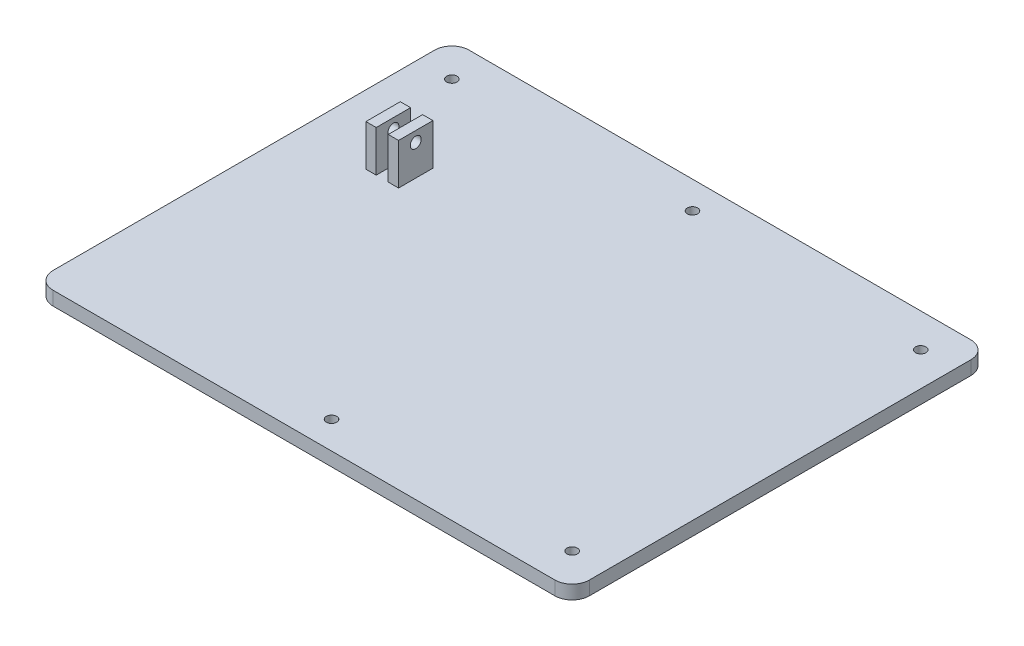
ISO-10303-21;
HEADER;
FILE_DESCRIPTION(('STEP AP214'),'2;1');
FILE_NAME('part.step','',(''),(''),'','','');
FILE_SCHEMA(('AUTOMOTIVE_DESIGN { 1 0 10303 214 1 1 1 1 }'));
ENDSEC;
DATA;
#1=APPLICATION_CONTEXT('core data for automotive mechanical design processes');
#2=APPLICATION_PROTOCOL_DEFINITION('international standard','automotive_design',2000,#1);
#3=PRODUCT_CONTEXT('',#1,'mechanical');
#4=PRODUCT('Part','Part','',(#3));
#5=PRODUCT_RELATED_PRODUCT_CATEGORY('part','',(#4));
#6=PRODUCT_DEFINITION_FORMATION('','',#4);
#7=PRODUCT_DEFINITION_CONTEXT('part definition',#1,'design');
#8=PRODUCT_DEFINITION('design','',#6,#7);
#9=PRODUCT_DEFINITION_SHAPE('','',#8);
#10=(LENGTH_UNIT() NAMED_UNIT(*) SI_UNIT(.MILLI.,.METRE.));
#11=(NAMED_UNIT(*) PLANE_ANGLE_UNIT() SI_UNIT($,.RADIAN.));
#12=(NAMED_UNIT(*) SI_UNIT($,.STERADIAN.) SOLID_ANGLE_UNIT());
#13=UNCERTAINTY_MEASURE_WITH_UNIT(LENGTH_MEASURE(1.E-05),#10,'distance_accuracy_value','');
#14=(GEOMETRIC_REPRESENTATION_CONTEXT(3) GLOBAL_UNCERTAINTY_ASSIGNED_CONTEXT((#13)) GLOBAL_UNIT_ASSIGNED_CONTEXT((#10,
#11,#12)) REPRESENTATION_CONTEXT('',''));
#15=CARTESIAN_POINT('',(0.,0.,0.));
#16=DIRECTION('',(0.,0.,1.));
#17=DIRECTION('',(1.,0.,0.));
#18=AXIS2_PLACEMENT_3D('',#15,#16,#17);
#19=CARTESIAN_POINT('',(0.,4.,0.));
#20=DIRECTION('',(0.,-1.,0.));
#21=DIRECTION('',(0.,0.,-1.));
#22=AXIS2_PLACEMENT_3D('',#19,#20,#21);
#23=PLANE('',#22);
#24=CARTESIAN_POINT('',(-29.1272060053833,4.,15.0292186824437));
#25=DIRECTION('',(0.,1.,0.));
#26=DIRECTION('',(0.,0.,1.));
#27=AXIS2_PLACEMENT_3D('',#24,#25,#26);
#28=CIRCLE('',#27,1.);
#29=CARTESIAN_POINT('',(-29.1272060053833,4.,16.0292186824437));
#30=VERTEX_POINT('',#29);
#31=EDGE_CURVE('E312',#30,#30,#28,.T.);
#32=ORIENTED_EDGE('',*,*,#31,.F.);
#33=EDGE_LOOP('',(#32));
#34=FACE_BOUND('',#33,.T.);
#35=DIRECTION('',(0.,0.,-1.));
#36=VECTOR('',#35,1.);
#37=CARTESIAN_POINT('',(-30.6280356985237,4.,9.78105868106154));
#38=LINE('',#37,#36);
#39=CARTESIAN_POINT('',(-30.6280356985237,4.,19.7810586810616));
#40=VERTEX_POINT('',#39);
#41=CARTESIAN_POINT('',(-30.6280356985237,4.,9.78105868106154));
#42=VERTEX_POINT('',#41);
#43=EDGE_CURVE('E153',#40,#42,#38,.T.);
#44=ORIENTED_EDGE('',*,*,#43,.F.);
#45=DIRECTION('',(1.,0.,0.));
#46=VECTOR('',#45,1.);
#47=CARTESIAN_POINT('',(-30.6280356985237,4.,19.7810586810616));
#48=LINE('',#47,#46);
#49=CARTESIAN_POINT('',(-33.6280356985237,4.,19.7810586810615));
#50=VERTEX_POINT('',#49);
#51=EDGE_CURVE('E186',#50,#40,#48,.T.);
#52=ORIENTED_EDGE('',*,*,#51,.F.);
#53=DIRECTION('',(0.,0.,1.));
#54=VECTOR('',#53,1.);
#55=CARTESIAN_POINT('',(-33.6280356985237,4.,9.78105868106155));
#56=LINE('',#55,#54);
#57=CARTESIAN_POINT('',(-33.6280356985237,4.,9.78105868106155));
#58=VERTEX_POINT('',#57);
#59=EDGE_CURVE('E198',#58,#50,#56,.T.);
#60=ORIENTED_EDGE('',*,*,#59,.F.);
#61=DIRECTION('',(-1.,0.,0.));
#62=VECTOR('',#61,1.);
#63=CARTESIAN_POINT('',(-30.6280356985237,4.,9.78105868106154));
#64=LINE('',#63,#62);
#65=EDGE_CURVE('E195',#42,#58,#64,.T.);
#66=ORIENTED_EDGE('',*,*,#65,.F.);
#67=EDGE_LOOP('',(#44,#52,#60,#66));
#68=FACE_BOUND('',#67,.T.);
#69=CARTESIAN_POINT('',(-43.8247348396246,4.,-15.4156404600393));
#70=DIRECTION('',(0.,1.,0.));
#71=DIRECTION('',(0.,0.,1.));
#72=AXIS2_PLACEMENT_3D('',#69,#70,#71);
#73=CIRCLE('',#72,1.5);
#74=CARTESIAN_POINT('',(-43.8247348396246,4.,-13.9156404600393));
#75=VERTEX_POINT('',#74);
#76=EDGE_CURVE('E219',#75,#75,#73,.T.);
#77=ORIENTED_EDGE('',*,*,#76,.F.);
#78=EDGE_LOOP('',(#77));
#79=FACE_BOUND('',#78,.T.);
#80=CARTESIAN_POINT('',(24.3719643014763,4.,-17.2189413189384));
#81=DIRECTION('',(0.,1.,0.));
#82=DIRECTION('',(0.,0.,1.));
#83=AXIS2_PLACEMENT_3D('',#80,#81,#82);
#84=CIRCLE('',#83,1.5);
#85=CARTESIAN_POINT('',(24.3719643014763,4.,-15.7189413189384));
#86=VERTEX_POINT('',#85);
#87=EDGE_CURVE('E222',#86,#86,#84,.T.);
#88=ORIENTED_EDGE('',*,*,#87,.F.);
#89=EDGE_LOOP('',(#88));
#90=FACE_BOUND('',#89,.T.);
#91=CARTESIAN_POINT('',(92.5686634425771,4.,-15.4156404600393));
#92=DIRECTION('',(0.,1.,0.));
#93=DIRECTION('',(0.,0.,1.));
#94=AXIS2_PLACEMENT_3D('',#91,#92,#93);
#95=CIRCLE('',#94,1.5);
#96=CARTESIAN_POINT('',(92.5686634425771,4.,-13.9156404600393));
#97=VERTEX_POINT('',#96);
#98=EDGE_CURVE('E228',#97,#97,#95,.T.);
#99=ORIENTED_EDGE('',*,*,#98,.F.);
#100=EDGE_LOOP('',(#99));
#101=FACE_BOUND('',#100,.T.);
#102=CARTESIAN_POINT('',(24.3719643014763,4.,87.7810586810615));
#103=DIRECTION('',(0.,1.,0.));
#104=DIRECTION('',(0.,0.,1.));
#105=AXIS2_PLACEMENT_3D('',#102,#103,#104);
#106=CIRCLE('',#105,1.5);
#107=CARTESIAN_POINT('',(24.3719643014763,4.,89.2810586810615));
#108=VERTEX_POINT('',#107);
#109=EDGE_CURVE('E234',#108,#108,#106,.T.);
#110=ORIENTED_EDGE('',*,*,#109,.F.);
#111=EDGE_LOOP('',(#110));
#112=FACE_BOUND('',#111,.T.);
#113=CARTESIAN_POINT('',(92.5686634425772,4.,85.9777578221625));
#114=DIRECTION('',(0.,1.,0.));
#115=DIRECTION('',(0.,0.,1.));
#116=AXIS2_PLACEMENT_3D('',#113,#114,#115);
#117=CIRCLE('',#116,1.5);
#118=CARTESIAN_POINT('',(92.5686634425772,4.,87.4777578221625));
#119=VERTEX_POINT('',#118);
#120=EDGE_CURVE('E240',#119,#119,#117,.T.);
#121=ORIENTED_EDGE('',*,*,#120,.F.);
#122=EDGE_LOOP('',(#121));
#123=FACE_BOUND('',#122,.T.);
#124=DIRECTION('',(1.,0.,0.));
#125=VECTOR('',#124,1.);
#126=CARTESIAN_POINT('',(-124.347339340326,4.,95.7810586810616));
#127=LINE('',#126,#125);
#128=CARTESIAN_POINT('',(-48.6280356985237,4.,95.7810586810616));
#129=VERTEX_POINT('',#128);
#130=CARTESIAN_POINT('',(97.3719643014763,4.,95.7810586810616));
#131=VERTEX_POINT('',#130);
#132=EDGE_CURVE('E282',#129,#131,#127,.T.);
#133=ORIENTED_EDGE('',*,*,#132,.T.);
#134=CARTESIAN_POINT('',(97.3719643014763,4.,90.7810586810616));
#135=DIRECTION('',(0.,-1.,0.));
#136=DIRECTION('',(0.,0.,1.));
#137=AXIS2_PLACEMENT_3D('',#134,#135,#136);
#138=CIRCLE('',#137,5.);
#139=CARTESIAN_POINT('',(102.371964301476,4.,90.7810586810616));
#140=VERTEX_POINT('',#139);
#141=EDGE_CURVE('E262',#140,#131,#138,.T.);
#142=ORIENTED_EDGE('',*,*,#141,.F.);
#143=DIRECTION('',(0.,0.,1.));
#144=VECTOR('',#143,1.);
#145=CARTESIAN_POINT('',(102.371964301476,4.,90.7810586810616));
#146=LINE('',#145,#144);
#147=CARTESIAN_POINT('',(102.371964301476,4.,-20.2189413189384));
#148=VERTEX_POINT('',#147);
#149=EDGE_CURVE('E259',#148,#140,#146,.T.);
#150=ORIENTED_EDGE('',*,*,#149,.F.);
#151=CARTESIAN_POINT('',(97.3719643014763,4.,-20.2189413189384));
#152=DIRECTION('',(0.,-1.,0.));
#153=DIRECTION('',(0.,0.,1.));
#154=AXIS2_PLACEMENT_3D('',#151,#152,#153);
#155=CIRCLE('',#154,5.);
#156=CARTESIAN_POINT('',(97.3719643014763,4.,-25.2189413189384));
#157=VERTEX_POINT('',#156);
#158=EDGE_CURVE('E256',#157,#148,#155,.T.);
#159=ORIENTED_EDGE('',*,*,#158,.F.);
#160=DIRECTION('',(1.,0.,0.));
#161=VECTOR('',#160,1.);
#162=CARTESIAN_POINT('',(97.3719643014763,4.,-25.2189413189384));
#163=LINE('',#162,#161);
#164=CARTESIAN_POINT('',(-48.6280356985237,4.,-25.2189413189385));
#165=VERTEX_POINT('',#164);
#166=EDGE_CURVE('E253',#165,#157,#163,.T.);
#167=ORIENTED_EDGE('',*,*,#166,.F.);
#168=CARTESIAN_POINT('',(-48.6280356985237,4.,-20.2189413189385));
#169=DIRECTION('',(0.,-1.,0.));
#170=DIRECTION('',(0.,0.,1.));
#171=AXIS2_PLACEMENT_3D('',#168,#169,#170);
#172=CIRCLE('',#171,5.);
#173=CARTESIAN_POINT('',(-53.6280356985237,4.,-20.2189413189385));
#174=VERTEX_POINT('',#173);
#175=EDGE_CURVE('E250',#174,#165,#172,.T.);
#176=ORIENTED_EDGE('',*,*,#175,.F.);
#177=DIRECTION('',(0.,0.,-1.));
#178=VECTOR('',#177,1.);
#179=CARTESIAN_POINT('',(-53.6280356985237,4.,-20.2189413189385));
#180=LINE('',#179,#178);
#181=CARTESIAN_POINT('',(-53.6280356985237,4.,90.7810586810616));
#182=VERTEX_POINT('',#181);
#183=EDGE_CURVE('E247',#182,#174,#180,.T.);
#184=ORIENTED_EDGE('',*,*,#183,.F.);
#185=CARTESIAN_POINT('',(-48.6280356985237,4.,90.7810586810616));
#186=DIRECTION('',(0.,-1.,0.));
#187=DIRECTION('',(0.,0.,1.));
#188=AXIS2_PLACEMENT_3D('',#185,#186,#187);
#189=CIRCLE('',#188,5.);
#190=EDGE_CURVE('E218',#129,#182,#189,.T.);
#191=ORIENTED_EDGE('',*,*,#190,.F.);
#192=EDGE_LOOP('',(#133,#142,#150,#159,#167,#176,#184,#191));
#193=FACE_BOUND('',#192,.T.);
#194=DIRECTION('',(0.,0.,-1.));
#195=VECTOR('',#194,1.);
#196=CARTESIAN_POINT('',(-24.1280356985237,4.,9.78105868106155));
#197=LINE('',#196,#195);
#198=CARTESIAN_POINT('',(-24.1280356985237,4.,19.7810586810615));
#199=VERTEX_POINT('',#198);
#200=CARTESIAN_POINT('',(-24.1280356985237,4.,9.78105868106155));
#201=VERTEX_POINT('',#200);
#202=EDGE_CURVE('E147',#199,#201,#197,.T.);
#203=ORIENTED_EDGE('',*,*,#202,.F.);
#204=DIRECTION('',(1.,0.,0.));
#205=VECTOR('',#204,1.);
#206=CARTESIAN_POINT('',(-24.1280356985237,4.,19.7810586810615));
#207=LINE('',#206,#205);
#208=CARTESIAN_POINT('',(-27.1280356985237,4.,19.7810586810615));
#209=VERTEX_POINT('',#208);
#210=EDGE_CURVE('E149',#209,#199,#207,.T.);
#211=ORIENTED_EDGE('',*,*,#210,.F.);
#212=DIRECTION('',(0.,0.,1.));
#213=VECTOR('',#212,1.);
#214=CARTESIAN_POINT('',(-27.1280356985237,4.,9.78105868106155));
#215=LINE('',#214,#213);
#216=CARTESIAN_POINT('',(-27.1280356985237,4.,9.78105868106155));
#217=VERTEX_POINT('',#216);
#218=EDGE_CURVE('E59',#217,#209,#215,.T.);
#219=ORIENTED_EDGE('',*,*,#218,.F.);
#220=DIRECTION('',(-1.,0.,0.));
#221=VECTOR('',#220,1.);
#222=CARTESIAN_POINT('',(-24.1280356985237,4.,9.78105868106155));
#223=LINE('',#222,#221);
#224=EDGE_CURVE('E54',#201,#217,#223,.T.);
#225=ORIENTED_EDGE('',*,*,#224,.F.);
#226=EDGE_LOOP('',(#203,#211,#219,#225));
#227=FACE_BOUND('',#226,.T.);
#228=ADVANCED_FACE('F37',(#34,#68,#79,#90,#101,#112,#123,#193,#227),#23,.F.);
#229=CARTESIAN_POINT('',(-124.347339340326,4.,95.7810586810616));
#230=DIRECTION('',(0.,0.,-1.));
#231=DIRECTION('',(-1.,0.,0.));
#232=AXIS2_PLACEMENT_3D('',#229,#230,#231);
#233=PLANE('',#232);
#234=DIRECTION('',(0.,1.,0.));
#235=VECTOR('',#234,1.);
#236=CARTESIAN_POINT('',(97.3719643014763,-6.,95.7810586810616));
#237=LINE('',#236,#235);
#238=CARTESIAN_POINT('',(97.3719643014763,0.,95.7810586810616));
#239=VERTEX_POINT('',#238);
#240=EDGE_CURVE('E265',#239,#131,#237,.T.);
#241=ORIENTED_EDGE('',*,*,#240,.T.);
#242=ORIENTED_EDGE('',*,*,#132,.F.);
#243=DIRECTION('',(0.,1.,0.));
#244=VECTOR('',#243,1.);
#245=CARTESIAN_POINT('',(-48.6280356985237,-6.,95.7810586810616));
#246=LINE('',#245,#244);
#247=CARTESIAN_POINT('',(-48.6280356985237,0.,95.7810586810616));
#248=VERTEX_POINT('',#247);
#249=EDGE_CURVE('E264',#248,#129,#246,.T.);
#250=ORIENTED_EDGE('',*,*,#249,.F.);
#251=DIRECTION('',(1.,0.,0.));
#252=VECTOR('',#251,1.);
#253=CARTESIAN_POINT('',(-124.347339340326,0.,95.7810586810616));
#254=LINE('',#253,#252);
#255=EDGE_CURVE('E268',#248,#239,#254,.T.);
#256=ORIENTED_EDGE('',*,*,#255,.T.);
#257=EDGE_LOOP('',(#241,#242,#250,#256));
#258=FACE_BOUND('',#257,.T.);
#259=ADVANCED_FACE('F39',(#258),#233,.F.);
#260=CARTESIAN_POINT('',(0.,0.,0.));
#261=DIRECTION('',(0.,-1.,0.));
#262=DIRECTION('',(0.,0.,-1.));
#263=AXIS2_PLACEMENT_3D('',#260,#261,#262);
#264=PLANE('',#263);
#265=CARTESIAN_POINT('',(-29.1272060053833,0.,15.0292186824437));
#266=DIRECTION('',(0.,-1.,0.));
#267=DIRECTION('',(0.,0.,-1.));
#268=AXIS2_PLACEMENT_3D('',#265,#266,#267);
#269=CIRCLE('',#268,1.);
#270=CARTESIAN_POINT('',(-29.1272060053833,0.,14.0292186824437));
#271=VERTEX_POINT('',#270);
#272=EDGE_CURVE('E41',#271,#271,#269,.T.);
#273=ORIENTED_EDGE('',*,*,#272,.F.);
#274=EDGE_LOOP('',(#273));
#275=FACE_BOUND('',#274,.T.);
#276=CARTESIAN_POINT('',(-43.8247348396246,0.,-15.4156404600393));
#277=DIRECTION('',(0.,1.,0.));
#278=DIRECTION('',(0.,0.,1.));
#279=AXIS2_PLACEMENT_3D('',#276,#277,#278);
#280=CIRCLE('',#279,1.5);
#281=CARTESIAN_POINT('',(-43.8247348396246,0.,-13.9156404600393));
#282=VERTEX_POINT('',#281);
#283=EDGE_CURVE('E215',#282,#282,#280,.T.);
#284=ORIENTED_EDGE('',*,*,#283,.T.);
#285=EDGE_LOOP('',(#284));
#286=FACE_BOUND('',#285,.T.);
#287=CARTESIAN_POINT('',(24.3719643014763,0.,-17.2189413189384));
#288=DIRECTION('',(0.,1.,0.));
#289=DIRECTION('',(0.,0.,1.));
#290=AXIS2_PLACEMENT_3D('',#287,#288,#289);
#291=CIRCLE('',#290,1.5);
#292=CARTESIAN_POINT('',(24.3719643014763,0.,-15.7189413189384));
#293=VERTEX_POINT('',#292);
#294=EDGE_CURVE('E225',#293,#293,#291,.T.);
#295=ORIENTED_EDGE('',*,*,#294,.T.);
#296=EDGE_LOOP('',(#295));
#297=FACE_BOUND('',#296,.T.);
#298=CARTESIAN_POINT('',(92.5686634425771,0.,-15.4156404600393));
#299=DIRECTION('',(0.,1.,0.));
#300=DIRECTION('',(0.,0.,1.));
#301=AXIS2_PLACEMENT_3D('',#298,#299,#300);
#302=CIRCLE('',#301,1.5);
#303=CARTESIAN_POINT('',(92.5686634425771,0.,-13.9156404600393));
#304=VERTEX_POINT('',#303);
#305=EDGE_CURVE('E231',#304,#304,#302,.T.);
#306=ORIENTED_EDGE('',*,*,#305,.T.);
#307=EDGE_LOOP('',(#306));
#308=FACE_BOUND('',#307,.T.);
#309=CARTESIAN_POINT('',(24.3719643014763,0.,87.7810586810615));
#310=DIRECTION('',(0.,1.,0.));
#311=DIRECTION('',(0.,0.,1.));
#312=AXIS2_PLACEMENT_3D('',#309,#310,#311);
#313=CIRCLE('',#312,1.5);
#314=CARTESIAN_POINT('',(24.3719643014763,0.,89.2810586810615));
#315=VERTEX_POINT('',#314);
#316=EDGE_CURVE('E237',#315,#315,#313,.T.);
#317=ORIENTED_EDGE('',*,*,#316,.T.);
#318=EDGE_LOOP('',(#317));
#319=FACE_BOUND('',#318,.T.);
#320=CARTESIAN_POINT('',(92.5686634425772,0.,85.9777578221625));
#321=DIRECTION('',(0.,1.,0.));
#322=DIRECTION('',(0.,0.,1.));
#323=AXIS2_PLACEMENT_3D('',#320,#321,#322);
#324=CIRCLE('',#323,1.5);
#325=CARTESIAN_POINT('',(92.5686634425772,0.,87.4777578221625));
#326=VERTEX_POINT('',#325);
#327=EDGE_CURVE('E214',#326,#326,#324,.T.);
#328=ORIENTED_EDGE('',*,*,#327,.T.);
#329=EDGE_LOOP('',(#328));
#330=FACE_BOUND('',#329,.T.);
#331=CARTESIAN_POINT('',(97.3719643014763,0.,90.7810586810616));
#332=DIRECTION('',(0.,-1.,0.));
#333=DIRECTION('',(0.,0.,-1.));
#334=AXIS2_PLACEMENT_3D('',#331,#332,#333);
#335=CIRCLE('',#334,5.);
#336=CARTESIAN_POINT('',(102.371964301476,0.,90.7810586810616));
#337=VERTEX_POINT('',#336);
#338=EDGE_CURVE('E11',#239,#337,#335,.F.);
#339=ORIENTED_EDGE('',*,*,#338,.F.);
#340=ORIENTED_EDGE('',*,*,#255,.F.);
#341=CARTESIAN_POINT('',(-48.6280356985237,0.,90.7810586810616));
#342=DIRECTION('',(0.,-1.,0.));
#343=DIRECTION('',(0.,0.,-1.));
#344=AXIS2_PLACEMENT_3D('',#341,#342,#343);
#345=CIRCLE('',#344,5.);
#346=CARTESIAN_POINT('',(-53.6280356985237,0.,90.7810586810616));
#347=VERTEX_POINT('',#346);
#348=EDGE_CURVE('E285',#347,#248,#345,.F.);
#349=ORIENTED_EDGE('',*,*,#348,.F.);
#350=DIRECTION('',(0.,0.,1.));
#351=VECTOR('',#350,1.);
#352=CARTESIAN_POINT('',(-53.6280356985237,0.,0.));
#353=LINE('',#352,#351);
#354=CARTESIAN_POINT('',(-53.6280356985237,0.,-20.2189413189385));
#355=VERTEX_POINT('',#354);
#356=EDGE_CURVE('E289',#355,#347,#353,.T.);
#357=ORIENTED_EDGE('',*,*,#356,.F.);
#358=CARTESIAN_POINT('',(-48.6280356985237,0.,-20.2189413189385));
#359=DIRECTION('',(0.,-1.,0.));
#360=DIRECTION('',(0.,0.,-1.));
#361=AXIS2_PLACEMENT_3D('',#358,#359,#360);
#362=CIRCLE('',#361,5.);
#363=CARTESIAN_POINT('',(-48.6280356985237,0.,-25.2189413189385));
#364=VERTEX_POINT('',#363);
#365=EDGE_CURVE('E292',#364,#355,#362,.F.);
#366=ORIENTED_EDGE('',*,*,#365,.F.);
#367=DIRECTION('',(-1.,0.,0.));
#368=VECTOR('',#367,1.);
#369=CARTESIAN_POINT('',(0.,0.,-25.2189413189385));
#370=LINE('',#369,#368);
#371=CARTESIAN_POINT('',(97.3719643014763,0.,-25.2189413189384));
#372=VERTEX_POINT('',#371);
#373=EDGE_CURVE('E294',#372,#364,#370,.T.);
#374=ORIENTED_EDGE('',*,*,#373,.F.);
#375=CARTESIAN_POINT('',(97.3719643014763,0.,-20.2189413189384));
#376=DIRECTION('',(0.,-1.,0.));
#377=DIRECTION('',(0.,0.,-1.));
#378=AXIS2_PLACEMENT_3D('',#375,#376,#377);
#379=CIRCLE('',#378,5.);
#380=CARTESIAN_POINT('',(102.371964301476,0.,-20.2189413189384));
#381=VERTEX_POINT('',#380);
#382=EDGE_CURVE('E296',#381,#372,#379,.F.);
#383=ORIENTED_EDGE('',*,*,#382,.F.);
#384=DIRECTION('',(0.,0.,-1.));
#385=VECTOR('',#384,1.);
#386=CARTESIAN_POINT('',(102.371964301476,0.,0.));
#387=LINE('',#386,#385);
#388=EDGE_CURVE('E46',#337,#381,#387,.T.);
#389=ORIENTED_EDGE('',*,*,#388,.F.);
#390=EDGE_LOOP('',(#339,#340,#349,#357,#366,#374,#383,#389));
#391=FACE_BOUND('',#390,.T.);
#392=ADVANCED_FACE('F345',(#275,#286,#297,#308,#319,#330,#391),#264,.T.);
#393=CARTESIAN_POINT('',(97.3719643014763,-6.,90.7810586810616));
#394=DIRECTION('',(0.,1.,0.));
#395=DIRECTION('',(0.,0.,1.));
#396=AXIS2_PLACEMENT_3D('',#393,#394,#395);
#397=CYLINDRICAL_SURFACE('',#396,5.);
#398=ORIENTED_EDGE('',*,*,#338,.T.);
#399=DIRECTION('',(0.,1.,0.));
#400=VECTOR('',#399,1.);
#401=CARTESIAN_POINT('',(102.371964301476,-6.,90.7810586810616));
#402=LINE('',#401,#400);
#403=EDGE_CURVE('E269',#337,#140,#402,.T.);
#404=ORIENTED_EDGE('',*,*,#403,.T.);
#405=ORIENTED_EDGE('',*,*,#141,.T.);
#406=ORIENTED_EDGE('',*,*,#240,.F.);
#407=EDGE_LOOP('',(#398,#404,#405,#406));
#408=FACE_BOUND('',#407,.T.);
#409=ADVANCED_FACE('F353',(#408),#397,.T.);
#410=CARTESIAN_POINT('',(102.371964301476,-6.,90.7810586810616));
#411=DIRECTION('',(-1.,0.,0.));
#412=DIRECTION('',(0.,0.,1.));
#413=AXIS2_PLACEMENT_3D('',#410,#411,#412);
#414=PLANE('',#413);
#415=ORIENTED_EDGE('',*,*,#388,.T.);
#416=DIRECTION('',(0.,1.,0.));
#417=VECTOR('',#416,1.);
#418=CARTESIAN_POINT('',(102.371964301476,-6.,-20.2189413189384));
#419=LINE('',#418,#417);
#420=EDGE_CURVE('E271',#381,#148,#419,.T.);
#421=ORIENTED_EDGE('',*,*,#420,.T.);
#422=ORIENTED_EDGE('',*,*,#149,.T.);
#423=ORIENTED_EDGE('',*,*,#403,.F.);
#424=EDGE_LOOP('',(#415,#421,#422,#423));
#425=FACE_BOUND('',#424,.T.);
#426=ADVANCED_FACE('F358',(#425),#414,.F.);
#427=CARTESIAN_POINT('',(97.3719643014763,-6.,-20.2189413189384));
#428=DIRECTION('',(0.,1.,0.));
#429=DIRECTION('',(0.,0.,1.));
#430=AXIS2_PLACEMENT_3D('',#427,#428,#429);
#431=CYLINDRICAL_SURFACE('',#430,5.);
#432=ORIENTED_EDGE('',*,*,#382,.T.);
#433=DIRECTION('',(0.,1.,0.));
#434=VECTOR('',#433,1.);
#435=CARTESIAN_POINT('',(97.3719643014763,-6.,-25.2189413189384));
#436=LINE('',#435,#434);
#437=EDGE_CURVE('E273',#372,#157,#436,.T.);
#438=ORIENTED_EDGE('',*,*,#437,.T.);
#439=ORIENTED_EDGE('',*,*,#158,.T.);
#440=ORIENTED_EDGE('',*,*,#420,.F.);
#441=EDGE_LOOP('',(#432,#438,#439,#440));
#442=FACE_BOUND('',#441,.T.);
#443=ADVANCED_FACE('F402',(#442),#431,.T.);
#444=CARTESIAN_POINT('',(97.3719643014763,-6.,-25.2189413189384));
#445=DIRECTION('',(0.,0.,1.));
#446=DIRECTION('',(1.,0.,0.));
#447=AXIS2_PLACEMENT_3D('',#444,#445,#446);
#448=PLANE('',#447);
#449=ORIENTED_EDGE('',*,*,#373,.T.);
#450=DIRECTION('',(0.,1.,0.));
#451=VECTOR('',#450,1.);
#452=CARTESIAN_POINT('',(-48.6280356985237,-6.,-25.2189413189385));
#453=LINE('',#452,#451);
#454=EDGE_CURVE('E275',#364,#165,#453,.T.);
#455=ORIENTED_EDGE('',*,*,#454,.T.);
#456=ORIENTED_EDGE('',*,*,#166,.T.);
#457=ORIENTED_EDGE('',*,*,#437,.F.);
#458=EDGE_LOOP('',(#449,#455,#456,#457));
#459=FACE_BOUND('',#458,.T.);
#460=ADVANCED_FACE('F398',(#459),#448,.F.);
#461=CARTESIAN_POINT('',(-48.6280356985237,-6.,-20.2189413189385));
#462=DIRECTION('',(0.,1.,0.));
#463=DIRECTION('',(0.,0.,1.));
#464=AXIS2_PLACEMENT_3D('',#461,#462,#463);
#465=CYLINDRICAL_SURFACE('',#464,5.);
#466=ORIENTED_EDGE('',*,*,#365,.T.);
#467=DIRECTION('',(0.,1.,0.));
#468=VECTOR('',#467,1.);
#469=CARTESIAN_POINT('',(-53.6280356985237,-6.,-20.2189413189385));
#470=LINE('',#469,#468);
#471=EDGE_CURVE('E277',#355,#174,#470,.T.);
#472=ORIENTED_EDGE('',*,*,#471,.T.);
#473=ORIENTED_EDGE('',*,*,#175,.T.);
#474=ORIENTED_EDGE('',*,*,#454,.F.);
#475=EDGE_LOOP('',(#466,#472,#473,#474));
#476=FACE_BOUND('',#475,.T.);
#477=ADVANCED_FACE('F396',(#476),#465,.T.);
#478=CARTESIAN_POINT('',(-53.6280356985237,-6.,-20.2189413189385));
#479=DIRECTION('',(1.,0.,0.));
#480=DIRECTION('',(0.,0.,-1.));
#481=AXIS2_PLACEMENT_3D('',#478,#479,#480);
#482=PLANE('',#481);
#483=ORIENTED_EDGE('',*,*,#356,.T.);
#484=DIRECTION('',(0.,1.,0.));
#485=VECTOR('',#484,1.);
#486=CARTESIAN_POINT('',(-53.6280356985237,-6.,90.7810586810616));
#487=LINE('',#486,#485);
#488=EDGE_CURVE('E279',#347,#182,#487,.T.);
#489=ORIENTED_EDGE('',*,*,#488,.T.);
#490=ORIENTED_EDGE('',*,*,#183,.T.);
#491=ORIENTED_EDGE('',*,*,#471,.F.);
#492=EDGE_LOOP('',(#483,#489,#490,#491));
#493=FACE_BOUND('',#492,.T.);
#494=ADVANCED_FACE('F390',(#493),#482,.F.);
#495=CARTESIAN_POINT('',(-48.6280356985237,-6.,90.7810586810616));
#496=DIRECTION('',(0.,1.,0.));
#497=DIRECTION('',(0.,0.,1.));
#498=AXIS2_PLACEMENT_3D('',#495,#496,#497);
#499=CYLINDRICAL_SURFACE('',#498,5.);
#500=ORIENTED_EDGE('',*,*,#348,.T.);
#501=ORIENTED_EDGE('',*,*,#249,.T.);
#502=ORIENTED_EDGE('',*,*,#190,.T.);
#503=ORIENTED_EDGE('',*,*,#488,.F.);
#504=EDGE_LOOP('',(#500,#501,#502,#503));
#505=FACE_BOUND('',#504,.T.);
#506=ADVANCED_FACE('F350',(#505),#499,.T.);
#507=CARTESIAN_POINT('',(92.5686634425772,0.,85.9777578221625));
#508=DIRECTION('',(0.,1.,0.));
#509=DIRECTION('',(0.,0.,1.));
#510=AXIS2_PLACEMENT_3D('',#507,#508,#509);
#511=CYLINDRICAL_SURFACE('',#510,1.5);
#512=ORIENTED_EDGE('',*,*,#327,.F.);
#513=EDGE_LOOP('',(#512));
#514=FACE_BOUND('',#513,.T.);
#515=ORIENTED_EDGE('',*,*,#120,.T.);
#516=EDGE_LOOP('',(#515));
#517=FACE_BOUND('',#516,.T.);
#518=ADVANCED_FACE('F421',(#514,#517),#511,.F.);
#519=CARTESIAN_POINT('',(24.3719643014763,0.,87.7810586810615));
#520=DIRECTION('',(0.,1.,0.));
#521=DIRECTION('',(0.,0.,1.));
#522=AXIS2_PLACEMENT_3D('',#519,#520,#521);
#523=CYLINDRICAL_SURFACE('',#522,1.5);
#524=ORIENTED_EDGE('',*,*,#316,.F.);
#525=EDGE_LOOP('',(#524));
#526=FACE_BOUND('',#525,.T.);
#527=ORIENTED_EDGE('',*,*,#109,.T.);
#528=EDGE_LOOP('',(#527));
#529=FACE_BOUND('',#528,.T.);
#530=ADVANCED_FACE('F425',(#526,#529),#523,.F.);
#531=CARTESIAN_POINT('',(92.5686634425771,0.,-15.4156404600393));
#532=DIRECTION('',(0.,1.,0.));
#533=DIRECTION('',(0.,0.,1.));
#534=AXIS2_PLACEMENT_3D('',#531,#532,#533);
#535=CYLINDRICAL_SURFACE('',#534,1.5);
#536=ORIENTED_EDGE('',*,*,#305,.F.);
#537=EDGE_LOOP('',(#536));
#538=FACE_BOUND('',#537,.T.);
#539=ORIENTED_EDGE('',*,*,#98,.T.);
#540=EDGE_LOOP('',(#539));
#541=FACE_BOUND('',#540,.T.);
#542=ADVANCED_FACE('F430',(#538,#541),#535,.F.);
#543=CARTESIAN_POINT('',(24.3719643014763,0.,-17.2189413189384));
#544=DIRECTION('',(0.,1.,0.));
#545=DIRECTION('',(0.,0.,1.));
#546=AXIS2_PLACEMENT_3D('',#543,#544,#545);
#547=CYLINDRICAL_SURFACE('',#546,1.5);
#548=ORIENTED_EDGE('',*,*,#294,.F.);
#549=EDGE_LOOP('',(#548));
#550=FACE_BOUND('',#549,.T.);
#551=ORIENTED_EDGE('',*,*,#87,.T.);
#552=EDGE_LOOP('',(#551));
#553=FACE_BOUND('',#552,.T.);
#554=ADVANCED_FACE('F437',(#550,#553),#547,.F.);
#555=CARTESIAN_POINT('',(-43.8247348396246,0.,-15.4156404600393));
#556=DIRECTION('',(0.,1.,0.));
#557=DIRECTION('',(0.,0.,1.));
#558=AXIS2_PLACEMENT_3D('',#555,#556,#557);
#559=CYLINDRICAL_SURFACE('',#558,1.5);
#560=ORIENTED_EDGE('',*,*,#283,.F.);
#561=EDGE_LOOP('',(#560));
#562=FACE_BOUND('',#561,.T.);
#563=ORIENTED_EDGE('',*,*,#76,.T.);
#564=EDGE_LOOP('',(#563));
#565=FACE_BOUND('',#564,.T.);
#566=ADVANCED_FACE('F441',(#562,#565),#559,.F.);
#567=CARTESIAN_POINT('',(-30.6280356985237,16.,9.78105868106154));
#568=DIRECTION('',(-1.,0.,0.));
#569=DIRECTION('',(0.,0.,1.));
#570=AXIS2_PLACEMENT_3D('',#567,#568,#569);
#571=PLANE('',#570);
#572=CARTESIAN_POINT('',(-30.6280356985237,13.,14.7810586810615));
#573=DIRECTION('',(-1.,0.,0.));
#574=DIRECTION('',(0.,0.,1.));
#575=AXIS2_PLACEMENT_3D('',#572,#573,#574);
#576=CIRCLE('',#575,1.6);
#577=CARTESIAN_POINT('',(-30.6280356985237,13.,16.3810586810615));
#578=VERTEX_POINT('',#577);
#579=EDGE_CURVE('E305',#578,#578,#576,.T.);
#580=ORIENTED_EDGE('',*,*,#579,.T.);
#581=EDGE_LOOP('',(#580));
#582=FACE_BOUND('',#581,.T.);
#583=ORIENTED_EDGE('',*,*,#43,.T.);
#584=DIRECTION('',(0.,-1.,0.));
#585=VECTOR('',#584,1.);
#586=CARTESIAN_POINT('',(-30.6280356985237,16.,9.78105868106154));
#587=LINE('',#586,#585);
#588=CARTESIAN_POINT('',(-30.6280356985237,16.,9.78105868106154));
#589=VERTEX_POINT('',#588);
#590=EDGE_CURVE('E211',#589,#42,#587,.T.);
#591=ORIENTED_EDGE('',*,*,#590,.F.);
#592=DIRECTION('',(0.,0.,-1.));
#593=VECTOR('',#592,1.);
#594=CARTESIAN_POINT('',(-30.6280356985237,16.,9.78105868106154));
#595=LINE('',#594,#593);
#596=CARTESIAN_POINT('',(-30.6280356985237,16.,19.7810586810616));
#597=VERTEX_POINT('',#596);
#598=EDGE_CURVE('E182',#597,#589,#595,.T.);
#599=ORIENTED_EDGE('',*,*,#598,.F.);
#600=DIRECTION('',(0.,-1.,0.));
#601=VECTOR('',#600,1.);
#602=CARTESIAN_POINT('',(-30.6280356985237,16.,19.7810586810616));
#603=LINE('',#602,#601);
#604=EDGE_CURVE('E192',#597,#40,#603,.T.);
#605=ORIENTED_EDGE('',*,*,#604,.T.);
#606=EDGE_LOOP('',(#583,#591,#599,#605));
#607=FACE_BOUND('',#606,.T.);
#608=ADVANCED_FACE('F445',(#582,#607),#571,.F.);
#609=CARTESIAN_POINT('',(-30.6280356985237,16.,9.78105868106154));
#610=DIRECTION('',(0.,0.,1.));
#611=DIRECTION('',(1.,0.,0.));
#612=AXIS2_PLACEMENT_3D('',#609,#610,#611);
#613=PLANE('',#612);
#614=ORIENTED_EDGE('',*,*,#65,.T.);
#615=DIRECTION('',(0.,-1.,0.));
#616=VECTOR('',#615,1.);
#617=CARTESIAN_POINT('',(-33.6280356985237,16.,9.78105868106155));
#618=LINE('',#617,#616);
#619=CARTESIAN_POINT('',(-33.6280356985237,16.,9.78105868106155));
#620=VERTEX_POINT('',#619);
#621=EDGE_CURVE('E208',#620,#58,#618,.T.);
#622=ORIENTED_EDGE('',*,*,#621,.F.);
#623=DIRECTION('',(-1.,0.,0.));
#624=VECTOR('',#623,1.);
#625=CARTESIAN_POINT('',(-30.6280356985237,16.,9.78105868106154));
#626=LINE('',#625,#624);
#627=EDGE_CURVE('E185',#589,#620,#626,.T.);
#628=ORIENTED_EDGE('',*,*,#627,.F.);
#629=ORIENTED_EDGE('',*,*,#590,.T.);
#630=EDGE_LOOP('',(#614,#622,#628,#629));
#631=FACE_BOUND('',#630,.T.);
#632=ADVANCED_FACE('F449',(#631),#613,.F.);
#633=CARTESIAN_POINT('',(-33.6280356985237,16.,9.78105868106155));
#634=DIRECTION('',(1.,0.,0.));
#635=DIRECTION('',(0.,0.,-1.));
#636=AXIS2_PLACEMENT_3D('',#633,#634,#635);
#637=PLANE('',#636);
#638=CARTESIAN_POINT('',(-33.6280356985237,13.,14.7810586810615));
#639=DIRECTION('',(-1.,0.,0.));
#640=DIRECTION('',(0.,0.,1.));
#641=AXIS2_PLACEMENT_3D('',#638,#639,#640);
#642=CIRCLE('',#641,1.6);
#643=CARTESIAN_POINT('',(-33.6280356985237,13.,16.3810586810615));
#644=VERTEX_POINT('',#643);
#645=EDGE_CURVE('E301',#644,#644,#642,.T.);
#646=ORIENTED_EDGE('',*,*,#645,.F.);
#647=EDGE_LOOP('',(#646));
#648=FACE_BOUND('',#647,.T.);
#649=ORIENTED_EDGE('',*,*,#59,.T.);
#650=DIRECTION('',(0.,-1.,0.));
#651=VECTOR('',#650,1.);
#652=CARTESIAN_POINT('',(-33.6280356985237,16.,19.7810586810615));
#653=LINE('',#652,#651);
#654=CARTESIAN_POINT('',(-33.6280356985237,16.,19.7810586810615));
#655=VERTEX_POINT('',#654);
#656=EDGE_CURVE('E205',#655,#50,#653,.T.);
#657=ORIENTED_EDGE('',*,*,#656,.F.);
#658=DIRECTION('',(0.,0.,1.));
#659=VECTOR('',#658,1.);
#660=CARTESIAN_POINT('',(-33.6280356985237,16.,9.78105868106155));
#661=LINE('',#660,#659);
#662=EDGE_CURVE('E188',#620,#655,#661,.T.);
#663=ORIENTED_EDGE('',*,*,#662,.F.);
#664=ORIENTED_EDGE('',*,*,#621,.T.);
#665=EDGE_LOOP('',(#649,#657,#663,#664));
#666=FACE_BOUND('',#665,.T.);
#667=ADVANCED_FACE('F453',(#648,#666),#637,.F.);
#668=CARTESIAN_POINT('',(-30.6280356985237,16.,19.7810586810616));
#669=DIRECTION('',(0.,0.,-1.));
#670=DIRECTION('',(-1.,0.,0.));
#671=AXIS2_PLACEMENT_3D('',#668,#669,#670);
#672=PLANE('',#671);
#673=ORIENTED_EDGE('',*,*,#51,.T.);
#674=ORIENTED_EDGE('',*,*,#604,.F.);
#675=DIRECTION('',(1.,0.,0.));
#676=VECTOR('',#675,1.);
#677=CARTESIAN_POINT('',(-30.6280356985237,16.,19.7810586810616));
#678=LINE('',#677,#676);
#679=EDGE_CURVE('E190',#655,#597,#678,.T.);
#680=ORIENTED_EDGE('',*,*,#679,.F.);
#681=ORIENTED_EDGE('',*,*,#656,.T.);
#682=EDGE_LOOP('',(#673,#674,#680,#681));
#683=FACE_BOUND('',#682,.T.);
#684=ADVANCED_FACE('F457',(#683),#672,.F.);
#685=CARTESIAN_POINT('',(0.,16.,0.));
#686=DIRECTION('',(0.,-1.,0.));
#687=DIRECTION('',(0.,0.,-1.));
#688=AXIS2_PLACEMENT_3D('',#685,#686,#687);
#689=PLANE('',#688);
#690=ORIENTED_EDGE('',*,*,#598,.T.);
#691=ORIENTED_EDGE('',*,*,#627,.T.);
#692=ORIENTED_EDGE('',*,*,#662,.T.);
#693=ORIENTED_EDGE('',*,*,#679,.T.);
#694=EDGE_LOOP('',(#690,#691,#692,#693));
#695=FACE_BOUND('',#694,.T.);
#696=ADVANCED_FACE('F460',(#695),#689,.F.);
#697=CARTESIAN_POINT('',(-24.1280356985237,16.,9.78105868106155));
#698=DIRECTION('',(-1.,0.,0.));
#699=DIRECTION('',(0.,0.,1.));
#700=AXIS2_PLACEMENT_3D('',#697,#698,#699);
#701=PLANE('',#700);
#702=CARTESIAN_POINT('',(-24.1280356985237,13.,14.7810586810615));
#703=DIRECTION('',(-1.,0.,0.));
#704=DIRECTION('',(0.,0.,1.));
#705=AXIS2_PLACEMENT_3D('',#702,#703,#704);
#706=CIRCLE('',#705,1.6);
#707=CARTESIAN_POINT('',(-24.1280356985237,13.,16.3810586810615));
#708=VERTEX_POINT('',#707);
#709=EDGE_CURVE('E300',#708,#708,#706,.T.);
#710=ORIENTED_EDGE('',*,*,#709,.T.);
#711=EDGE_LOOP('',(#710));
#712=FACE_BOUND('',#711,.T.);
#713=ORIENTED_EDGE('',*,*,#202,.T.);
#714=DIRECTION('',(0.,-1.,0.));
#715=VECTOR('',#714,1.);
#716=CARTESIAN_POINT('',(-24.1280356985237,16.,9.78105868106155));
#717=LINE('',#716,#715);
#718=CARTESIAN_POINT('',(-24.1280356985237,16.,9.78105868106155));
#719=VERTEX_POINT('',#718);
#720=EDGE_CURVE('E317',#719,#201,#717,.T.);
#721=ORIENTED_EDGE('',*,*,#720,.F.);
#722=DIRECTION('',(0.,0.,-1.));
#723=VECTOR('',#722,1.);
#724=CARTESIAN_POINT('',(-24.1280356985237,16.,9.78105868106155));
#725=LINE('',#724,#723);
#726=CARTESIAN_POINT('',(-24.1280356985237,16.,19.7810586810615));
#727=VERTEX_POINT('',#726);
#728=EDGE_CURVE('E164',#727,#719,#725,.T.);
#729=ORIENTED_EDGE('',*,*,#728,.F.);
#730=DIRECTION('',(0.,-1.,0.));
#731=VECTOR('',#730,1.);
#732=CARTESIAN_POINT('',(-24.1280356985237,16.,19.7810586810615));
#733=LINE('',#732,#731);
#734=EDGE_CURVE('E160',#727,#199,#733,.T.);
#735=ORIENTED_EDGE('',*,*,#734,.T.);
#736=EDGE_LOOP('',(#713,#721,#729,#735));
#737=FACE_BOUND('',#736,.T.);
#738=ADVANCED_FACE('F166',(#712,#737),#701,.F.);
#739=CARTESIAN_POINT('',(-24.1280356985237,16.,9.78105868106155));
#740=DIRECTION('',(0.,0.,1.));
#741=DIRECTION('',(1.,0.,0.));
#742=AXIS2_PLACEMENT_3D('',#739,#740,#741);
#743=PLANE('',#742);
#744=ORIENTED_EDGE('',*,*,#224,.T.);
#745=DIRECTION('',(0.,-1.,0.));
#746=VECTOR('',#745,1.);
#747=CARTESIAN_POINT('',(-27.1280356985237,16.,9.78105868106155));
#748=LINE('',#747,#746);
#749=CARTESIAN_POINT('',(-27.1280356985237,16.,9.78105868106155));
#750=VERTEX_POINT('',#749);
#751=EDGE_CURVE('E172',#750,#217,#748,.T.);
#752=ORIENTED_EDGE('',*,*,#751,.F.);
#753=DIRECTION('',(-1.,0.,0.));
#754=VECTOR('',#753,1.);
#755=CARTESIAN_POINT('',(-24.1280356985237,16.,9.78105868106155));
#756=LINE('',#755,#754);
#757=EDGE_CURVE('E179',#719,#750,#756,.T.);
#758=ORIENTED_EDGE('',*,*,#757,.F.);
#759=ORIENTED_EDGE('',*,*,#720,.T.);
#760=EDGE_LOOP('',(#744,#752,#758,#759));
#761=FACE_BOUND('',#760,.T.);
#762=ADVANCED_FACE('F324',(#761),#743,.F.);
#763=CARTESIAN_POINT('',(-27.1280356985237,16.,9.78105868106155));
#764=DIRECTION('',(1.,0.,0.));
#765=DIRECTION('',(0.,0.,-1.));
#766=AXIS2_PLACEMENT_3D('',#763,#764,#765);
#767=PLANE('',#766);
#768=CARTESIAN_POINT('',(-27.1280356985237,13.,14.7810586810615));
#769=DIRECTION('',(1.,0.,0.));
#770=DIRECTION('',(0.,0.,-1.));
#771=AXIS2_PLACEMENT_3D('',#768,#769,#770);
#772=CIRCLE('',#771,1.6);
#773=CARTESIAN_POINT('',(-27.1280356985237,13.,13.1810586810615));
#774=VERTEX_POINT('',#773);
#775=EDGE_CURVE('E298',#774,#774,#772,.T.);
#776=ORIENTED_EDGE('',*,*,#775,.T.);
#777=EDGE_LOOP('',(#776));
#778=FACE_BOUND('',#777,.T.);
#779=ORIENTED_EDGE('',*,*,#218,.T.);
#780=DIRECTION('',(0.,-1.,0.));
#781=VECTOR('',#780,1.);
#782=CARTESIAN_POINT('',(-27.1280356985237,16.,19.7810586810615));
#783=LINE('',#782,#781);
#784=CARTESIAN_POINT('',(-27.1280356985237,16.,19.7810586810615));
#785=VERTEX_POINT('',#784);
#786=EDGE_CURVE('E163',#785,#209,#783,.T.);
#787=ORIENTED_EDGE('',*,*,#786,.F.);
#788=DIRECTION('',(0.,0.,1.));
#789=VECTOR('',#788,1.);
#790=CARTESIAN_POINT('',(-27.1280356985237,16.,9.78105868106155));
#791=LINE('',#790,#789);
#792=EDGE_CURVE('E170',#750,#785,#791,.T.);
#793=ORIENTED_EDGE('',*,*,#792,.F.);
#794=ORIENTED_EDGE('',*,*,#751,.T.);
#795=EDGE_LOOP('',(#779,#787,#793,#794));
#796=FACE_BOUND('',#795,.T.);
#797=ADVANCED_FACE('F322',(#778,#796),#767,.F.);
#798=CARTESIAN_POINT('',(-24.1280356985237,16.,19.7810586810615));
#799=DIRECTION('',(0.,0.,-1.));
#800=DIRECTION('',(-1.,0.,0.));
#801=AXIS2_PLACEMENT_3D('',#798,#799,#800);
#802=PLANE('',#801);
#803=ORIENTED_EDGE('',*,*,#210,.T.);
#804=ORIENTED_EDGE('',*,*,#734,.F.);
#805=DIRECTION('',(1.,0.,0.));
#806=VECTOR('',#805,1.);
#807=CARTESIAN_POINT('',(-24.1280356985237,16.,19.7810586810615));
#808=LINE('',#807,#806);
#809=EDGE_CURVE('E168',#785,#727,#808,.T.);
#810=ORIENTED_EDGE('',*,*,#809,.F.);
#811=ORIENTED_EDGE('',*,*,#786,.T.);
#812=EDGE_LOOP('',(#803,#804,#810,#811));
#813=FACE_BOUND('',#812,.T.);
#814=ADVANCED_FACE('F158',(#813),#802,.F.);
#815=CARTESIAN_POINT('',(0.,16.,0.));
#816=DIRECTION('',(0.,-1.,0.));
#817=DIRECTION('',(0.,0.,-1.));
#818=AXIS2_PLACEMENT_3D('',#815,#816,#817);
#819=PLANE('',#818);
#820=ORIENTED_EDGE('',*,*,#728,.T.);
#821=ORIENTED_EDGE('',*,*,#757,.T.);
#822=ORIENTED_EDGE('',*,*,#792,.T.);
#823=ORIENTED_EDGE('',*,*,#809,.T.);
#824=EDGE_LOOP('',(#820,#821,#822,#823));
#825=FACE_BOUND('',#824,.T.);
#826=ADVANCED_FACE('F326',(#825),#819,.F.);
#827=CARTESIAN_POINT('',(-23.6280356985237,13.,14.7810586810615));
#828=DIRECTION('',(-1.,0.,0.));
#829=DIRECTION('',(0.,0.,1.));
#830=AXIS2_PLACEMENT_3D('',#827,#828,#829);
#831=CYLINDRICAL_SURFACE('',#830,1.6);
#832=ORIENTED_EDGE('',*,*,#775,.F.);
#833=EDGE_LOOP('',(#832));
#834=FACE_BOUND('',#833,.T.);
#835=ORIENTED_EDGE('',*,*,#709,.F.);
#836=EDGE_LOOP('',(#835));
#837=FACE_BOUND('',#836,.T.);
#838=ADVANCED_FACE('F328',(#834,#837),#831,.F.);
#839=ORIENTED_EDGE('',*,*,#645,.T.);
#840=EDGE_LOOP('',(#839));
#841=FACE_BOUND('',#840,.T.);
#842=ORIENTED_EDGE('',*,*,#579,.F.);
#843=EDGE_LOOP('',(#842));
#844=FACE_BOUND('',#843,.T.);
#845=ADVANCED_FACE('F334',(#841,#844),#831,.F.);
#846=CARTESIAN_POINT('',(-29.1272060053833,-2.,15.0292186824437));
#847=DIRECTION('',(0.,1.,0.));
#848=DIRECTION('',(0.,0.,1.));
#849=AXIS2_PLACEMENT_3D('',#846,#847,#848);
#850=CYLINDRICAL_SURFACE('',#849,1.);
#851=ORIENTED_EDGE('',*,*,#272,.T.);
#852=EDGE_LOOP('',(#851));
#853=FACE_BOUND('',#852,.T.);
#854=ORIENTED_EDGE('',*,*,#31,.T.);
#855=EDGE_LOOP('',(#854));
#856=FACE_BOUND('',#855,.T.);
#857=ADVANCED_FACE('F567',(#853,#856),#850,.F.);
#858=CLOSED_SHELL('',(#228,#259,#392,#409,#426,#443,#460,#477,#494,#506,#518,#530,#542,#554,
#566,#608,#632,#667,#684,#696,#738,#762,#797,#814,#826,#838,#845,#857));
#859=MANIFOLD_SOLID_BREP('B2',#858);
#860=ADVANCED_BREP_SHAPE_REPRESENTATION('',(#18,#859),#14);
#861=SHAPE_DEFINITION_REPRESENTATION(#9,#860);
ENDSEC;
END-ISO-10303-21;
